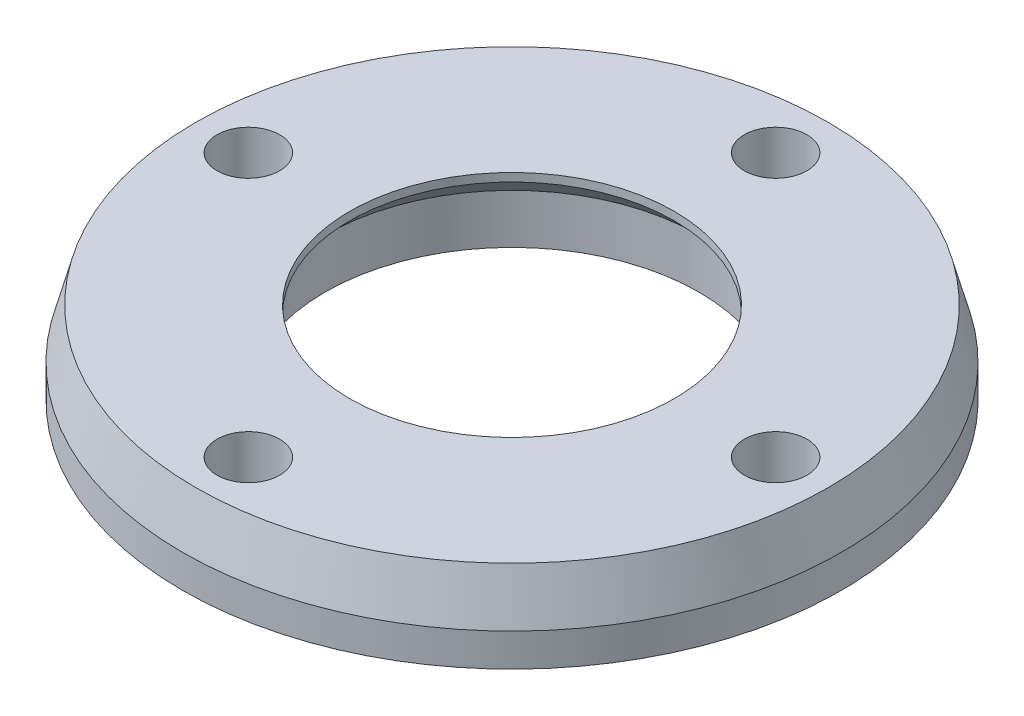
ISO-10303-21;
HEADER;
FILE_DESCRIPTION(('STEP AP214'),'2;1');
FILE_NAME('part.step','',(''),(''),'','','');
FILE_SCHEMA(('AUTOMOTIVE_DESIGN { 1 0 10303 214 1 1 1 1 }'));
ENDSEC;
DATA;
#1=APPLICATION_CONTEXT('core data for automotive mechanical design processes');
#2=APPLICATION_PROTOCOL_DEFINITION('international standard','automotive_design',2000,#1);
#3=PRODUCT_CONTEXT('',#1,'mechanical');
#4=PRODUCT('Part','Part','',(#3));
#5=PRODUCT_RELATED_PRODUCT_CATEGORY('part','',(#4));
#6=PRODUCT_DEFINITION_FORMATION('','',#4);
#7=PRODUCT_DEFINITION_CONTEXT('part definition',#1,'design');
#8=PRODUCT_DEFINITION('design','',#6,#7);
#9=PRODUCT_DEFINITION_SHAPE('','',#8);
#10=(LENGTH_UNIT() NAMED_UNIT(*) SI_UNIT(.MILLI.,.METRE.));
#11=(NAMED_UNIT(*) PLANE_ANGLE_UNIT() SI_UNIT($,.RADIAN.));
#12=(NAMED_UNIT(*) SI_UNIT($,.STERADIAN.) SOLID_ANGLE_UNIT());
#13=UNCERTAINTY_MEASURE_WITH_UNIT(LENGTH_MEASURE(1.E-05),#10,'distance_accuracy_value','');
#14=(GEOMETRIC_REPRESENTATION_CONTEXT(3) GLOBAL_UNCERTAINTY_ASSIGNED_CONTEXT((#13)) GLOBAL_UNIT_ASSIGNED_CONTEXT((#10,
#11,#12)) REPRESENTATION_CONTEXT('',''));
#15=CARTESIAN_POINT('',(0.,0.,0.));
#16=DIRECTION('',(0.,0.,1.));
#17=DIRECTION('',(1.,0.,0.));
#18=AXIS2_PLACEMENT_3D('',#15,#16,#17);
#19=CARTESIAN_POINT('',(0.,5.,0.));
#20=DIRECTION('',(0.,-1.,0.));
#21=DIRECTION('',(0.,0.,-1.));
#22=AXIS2_PLACEMENT_3D('',#19,#20,#21);
#23=CYLINDRICAL_SURFACE('',#22,11.35);
#24=CARTESIAN_POINT('',(0.,0.,0.));
#25=DIRECTION('',(0.,1.,0.));
#26=DIRECTION('',(0.,0.,1.));
#27=AXIS2_PLACEMENT_3D('',#24,#25,#26);
#28=CIRCLE('',#27,11.35);
#29=CARTESIAN_POINT('',(0.,0.,11.35));
#30=VERTEX_POINT('',#29);
#31=EDGE_CURVE('E58',#30,#30,#28,.T.);
#32=ORIENTED_EDGE('',*,*,#31,.F.);
#33=EDGE_LOOP('',(#32));
#34=FACE_BOUND('',#33,.T.);
#35=CARTESIAN_POINT('',(0.,3.,0.));
#36=DIRECTION('',(0.,1.,0.));
#37=DIRECTION('',(0.,0.,1.));
#38=AXIS2_PLACEMENT_3D('',#35,#36,#37);
#39=CIRCLE('',#38,11.35);
#40=CARTESIAN_POINT('',(0.,3.,-11.35));
#41=VERTEX_POINT('',#40);
#42=EDGE_CURVE('E83',#41,#41,#39,.T.);
#43=ORIENTED_EDGE('',*,*,#42,.T.);
#44=EDGE_LOOP('',(#43));
#45=FACE_BOUND('',#44,.T.);
#46=ADVANCED_FACE('F37',(#34,#45),#23,.F.);
#47=CARTESIAN_POINT('',(0.,5.,0.));
#48=DIRECTION('',(0.,1.,0.));
#49=DIRECTION('',(0.,0.,1.));
#50=AXIS2_PLACEMENT_3D('',#47,#48,#49);
#51=PLANE('',#50);
#52=CARTESIAN_POINT('',(0.,5.,0.));
#53=DIRECTION('',(0.,1.,0.));
#54=DIRECTION('',(0.,0.,1.));
#55=AXIS2_PLACEMENT_3D('',#52,#53,#54);
#56=CIRCLE('',#55,19.1961524227066);
#57=CARTESIAN_POINT('',(0.,5.,19.1961524227066));
#58=VERTEX_POINT('',#57);
#59=EDGE_CURVE('E49',#58,#58,#56,.T.);
#60=ORIENTED_EDGE('',*,*,#59,.T.);
#61=EDGE_LOOP('',(#60));
#62=FACE_BOUND('',#61,.T.);
#63=CARTESIAN_POINT('',(8.47262836995872E-13,5.,16.));
#64=DIRECTION('',(0.,1.,0.));
#65=DIRECTION('',(0.,0.,1.));
#66=AXIS2_PLACEMENT_3D('',#63,#64,#65);
#67=CIRCLE('',#66,1.9);
#68=CARTESIAN_POINT('',(8.47262836995872E-13,5.,17.9));
#69=VERTEX_POINT('',#68);
#70=EDGE_CURVE('E71',#69,#69,#67,.T.);
#71=ORIENTED_EDGE('',*,*,#70,.F.);
#72=EDGE_LOOP('',(#71));
#73=FACE_BOUND('',#72,.T.);
#74=CARTESIAN_POINT('',(0.,5.,-16.));
#75=DIRECTION('',(0.,1.,0.));
#76=DIRECTION('',(0.,0.,1.));
#77=AXIS2_PLACEMENT_3D('',#74,#75,#76);
#78=CIRCLE('',#77,1.9);
#79=CARTESIAN_POINT('',(0.,5.,-14.1));
#80=VERTEX_POINT('',#79);
#81=EDGE_CURVE('E61',#80,#80,#78,.T.);
#82=ORIENTED_EDGE('',*,*,#81,.F.);
#83=EDGE_LOOP('',(#82));
#84=FACE_BOUND('',#83,.T.);
#85=CARTESIAN_POINT('',(16.0000000000004,5.,-4.23631418497936E-13));
#86=DIRECTION('',(0.,1.,0.));
#87=DIRECTION('',(0.,0.,1.));
#88=AXIS2_PLACEMENT_3D('',#85,#86,#87);
#89=CIRCLE('',#88,1.9);
#90=CARTESIAN_POINT('',(16.0000000000004,5.,1.89999999999957));
#91=VERTEX_POINT('',#90);
#92=EDGE_CURVE('E65',#91,#91,#89,.T.);
#93=ORIENTED_EDGE('',*,*,#92,.F.);
#94=EDGE_LOOP('',(#93));
#95=FACE_BOUND('',#94,.T.);
#96=CARTESIAN_POINT('',(-15.9999999999996,5.,4.25590853376572E-13));
#97=DIRECTION('',(0.,1.,0.));
#98=DIRECTION('',(0.,0.,1.));
#99=AXIS2_PLACEMENT_3D('',#96,#97,#98);
#100=CIRCLE('',#99,1.9);
#101=CARTESIAN_POINT('',(-15.9999999999996,5.,1.90000000000043));
#102=VERTEX_POINT('',#101);
#103=EDGE_CURVE('E77',#102,#102,#100,.T.);
#104=ORIENTED_EDGE('',*,*,#103,.F.);
#105=EDGE_LOOP('',(#104));
#106=FACE_BOUND('',#105,.T.);
#107=CARTESIAN_POINT('',(0.,5.,0.));
#108=DIRECTION('',(0.,1.,0.));
#109=DIRECTION('',(0.,0.,1.));
#110=AXIS2_PLACEMENT_3D('',#107,#108,#109);
#111=CIRCLE('',#110,9.85);
#112=CARTESIAN_POINT('',(0.,5.,9.85));
#113=VERTEX_POINT('',#112);
#114=EDGE_CURVE('E88',#113,#113,#111,.T.);
#115=ORIENTED_EDGE('',*,*,#114,.F.);
#116=EDGE_LOOP('',(#115));
#117=FACE_BOUND('',#116,.T.);
#118=ADVANCED_FACE('F94',(#62,#73,#84,#95,#106,#117),#51,.T.);
#119=CARTESIAN_POINT('',(0.,0.,0.));
#120=DIRECTION('',(0.,1.,0.));
#121=DIRECTION('',(0.,0.,1.));
#122=AXIS2_PLACEMENT_3D('',#119,#120,#121);
#123=PLANE('',#122);
#124=CARTESIAN_POINT('',(0.,0.,0.));
#125=DIRECTION('',(0.,1.,0.));
#126=DIRECTION('',(0.,0.,1.));
#127=AXIS2_PLACEMENT_3D('',#124,#125,#126);
#128=CIRCLE('',#127,20.);
#129=CARTESIAN_POINT('',(0.,0.,20.));
#130=VERTEX_POINT('',#129);
#131=EDGE_CURVE('E53',#130,#130,#128,.T.);
#132=ORIENTED_EDGE('',*,*,#131,.F.);
#133=EDGE_LOOP('',(#132));
#134=FACE_BOUND('',#133,.T.);
#135=ORIENTED_EDGE('',*,*,#31,.T.);
#136=EDGE_LOOP('',(#135));
#137=FACE_BOUND('',#136,.T.);
#138=CARTESIAN_POINT('',(0.,0.,-16.));
#139=DIRECTION('',(0.,1.,0.));
#140=DIRECTION('',(0.,0.,1.));
#141=AXIS2_PLACEMENT_3D('',#138,#139,#140);
#142=CIRCLE('',#141,1.9);
#143=CARTESIAN_POINT('',(0.,0.,-14.1));
#144=VERTEX_POINT('',#143);
#145=EDGE_CURVE('E62',#144,#144,#142,.T.);
#146=ORIENTED_EDGE('',*,*,#145,.T.);
#147=EDGE_LOOP('',(#146));
#148=FACE_BOUND('',#147,.T.);
#149=CARTESIAN_POINT('',(16.0000000000004,0.,-4.23631418497936E-13));
#150=DIRECTION('',(0.,1.,0.));
#151=DIRECTION('',(0.,0.,1.));
#152=AXIS2_PLACEMENT_3D('',#149,#150,#151);
#153=CIRCLE('',#152,1.9);
#154=CARTESIAN_POINT('',(16.0000000000004,0.,1.89999999999957));
#155=VERTEX_POINT('',#154);
#156=EDGE_CURVE('E68',#155,#155,#153,.T.);
#157=ORIENTED_EDGE('',*,*,#156,.T.);
#158=EDGE_LOOP('',(#157));
#159=FACE_BOUND('',#158,.T.);
#160=CARTESIAN_POINT('',(8.47262836995872E-13,0.,16.));
#161=DIRECTION('',(0.,1.,0.));
#162=DIRECTION('',(0.,0.,1.));
#163=AXIS2_PLACEMENT_3D('',#160,#161,#162);
#164=CIRCLE('',#163,1.9);
#165=CARTESIAN_POINT('',(8.47262836995872E-13,0.,17.9));
#166=VERTEX_POINT('',#165);
#167=EDGE_CURVE('E74',#166,#166,#164,.T.);
#168=ORIENTED_EDGE('',*,*,#167,.T.);
#169=EDGE_LOOP('',(#168));
#170=FACE_BOUND('',#169,.T.);
#171=CARTESIAN_POINT('',(-15.9999999999996,0.,4.25590853376572E-13));
#172=DIRECTION('',(0.,1.,0.));
#173=DIRECTION('',(0.,0.,1.));
#174=AXIS2_PLACEMENT_3D('',#171,#172,#173);
#175=CIRCLE('',#174,1.9);
#176=CARTESIAN_POINT('',(-15.9999999999996,0.,1.90000000000043));
#177=VERTEX_POINT('',#176);
#178=EDGE_CURVE('E80',#177,#177,#175,.T.);
#179=ORIENTED_EDGE('',*,*,#178,.T.);
#180=EDGE_LOOP('',(#179));
#181=FACE_BOUND('',#180,.T.);
#182=ADVANCED_FACE('F96',(#134,#137,#148,#159,#170,#181),#123,.F.);
#183=CARTESIAN_POINT('',(0.,5.,0.));
#184=DIRECTION('',(0.,-1.,0.));
#185=DIRECTION('',(0.,0.,-1.));
#186=AXIS2_PLACEMENT_3D('',#183,#184,#185);
#187=CYLINDRICAL_SURFACE('',#186,20.);
#188=CARTESIAN_POINT('',(0.,2.00000000000002,0.));
#189=DIRECTION('',(0.,1.,0.));
#190=DIRECTION('',(0.,0.,1.));
#191=AXIS2_PLACEMENT_3D('',#188,#189,#190);
#192=CIRCLE('',#191,20.);
#193=CARTESIAN_POINT('',(0.,2.00000000000002,20.));
#194=VERTEX_POINT('',#193);
#195=EDGE_CURVE('E45',#194,#194,#192,.F.);
#196=ORIENTED_EDGE('',*,*,#195,.T.);
#197=EDGE_LOOP('',(#196));
#198=FACE_BOUND('',#197,.T.);
#199=ORIENTED_EDGE('',*,*,#131,.T.);
#200=EDGE_LOOP('',(#199));
#201=FACE_BOUND('',#200,.T.);
#202=ADVANCED_FACE('F103',(#198,#201),#187,.T.);
#203=CARTESIAN_POINT('',(0.,5.,-16.));
#204=DIRECTION('',(0.,-1.,0.));
#205=DIRECTION('',(0.,0.,-1.));
#206=AXIS2_PLACEMENT_3D('',#203,#204,#205);
#207=CYLINDRICAL_SURFACE('',#206,1.9);
#208=ORIENTED_EDGE('',*,*,#81,.T.);
#209=EDGE_LOOP('',(#208));
#210=FACE_BOUND('',#209,.T.);
#211=ORIENTED_EDGE('',*,*,#145,.F.);
#212=EDGE_LOOP('',(#211));
#213=FACE_BOUND('',#212,.T.);
#214=ADVANCED_FACE('F112',(#210,#213),#207,.F.);
#215=CARTESIAN_POINT('',(16.0000000000004,5.,-4.23631418497936E-13));
#216=DIRECTION('',(0.,-1.,0.));
#217=DIRECTION('',(0.,0.,-1.));
#218=AXIS2_PLACEMENT_3D('',#215,#216,#217);
#219=CYLINDRICAL_SURFACE('',#218,1.9);
#220=ORIENTED_EDGE('',*,*,#92,.T.);
#221=EDGE_LOOP('',(#220));
#222=FACE_BOUND('',#221,.T.);
#223=ORIENTED_EDGE('',*,*,#156,.F.);
#224=EDGE_LOOP('',(#223));
#225=FACE_BOUND('',#224,.T.);
#226=ADVANCED_FACE('F133',(#222,#225),#219,.F.);
#227=CARTESIAN_POINT('',(8.47262836995872E-13,5.,16.));
#228=DIRECTION('',(0.,-1.,0.));
#229=DIRECTION('',(0.,0.,-1.));
#230=AXIS2_PLACEMENT_3D('',#227,#228,#229);
#231=CYLINDRICAL_SURFACE('',#230,1.9);
#232=ORIENTED_EDGE('',*,*,#70,.T.);
#233=EDGE_LOOP('',(#232));
#234=FACE_BOUND('',#233,.T.);
#235=ORIENTED_EDGE('',*,*,#167,.F.);
#236=EDGE_LOOP('',(#235));
#237=FACE_BOUND('',#236,.T.);
#238=ADVANCED_FACE('F125',(#234,#237),#231,.F.);
#239=CARTESIAN_POINT('',(-15.9999999999996,5.,4.25590853376572E-13));
#240=DIRECTION('',(0.,-1.,0.));
#241=DIRECTION('',(0.,0.,-1.));
#242=AXIS2_PLACEMENT_3D('',#239,#240,#241);
#243=CYLINDRICAL_SURFACE('',#242,1.9);
#244=ORIENTED_EDGE('',*,*,#103,.T.);
#245=EDGE_LOOP('',(#244));
#246=FACE_BOUND('',#245,.T.);
#247=ORIENTED_EDGE('',*,*,#178,.F.);
#248=EDGE_LOOP('',(#247));
#249=FACE_BOUND('',#248,.T.);
#250=ADVANCED_FACE('F118',(#246,#249),#243,.F.);
#251=CARTESIAN_POINT('',(0.,5.,0.));
#252=DIRECTION('',(0.,-1.,0.));
#253=DIRECTION('',(0.,0.,-1.));
#254=AXIS2_PLACEMENT_3D('',#251,#252,#253);
#255=CONICAL_SURFACE('',#254,19.1961524227066,0.261799387799148);
#256=ORIENTED_EDGE('',*,*,#195,.F.);
#257=EDGE_LOOP('',(#256));
#258=FACE_BOUND('',#257,.T.);
#259=ORIENTED_EDGE('',*,*,#59,.F.);
#260=EDGE_LOOP('',(#259));
#261=FACE_BOUND('',#260,.T.);
#262=ADVANCED_FACE('F114',(#258,#261),#255,.T.);
#263=CARTESIAN_POINT('',(0.,3.,0.));
#264=DIRECTION('',(0.,1.,0.));
#265=DIRECTION('',(0.,0.,1.));
#266=AXIS2_PLACEMENT_3D('',#263,#264,#265);
#267=CYLINDRICAL_SURFACE('',#266,9.85);
#268=CARTESIAN_POINT('',(0.,4.5,0.));
#269=DIRECTION('',(0.,1.,0.));
#270=DIRECTION('',(0.,0.,1.));
#271=AXIS2_PLACEMENT_3D('',#268,#269,#270);
#272=CIRCLE('',#271,9.85);
#273=CARTESIAN_POINT('',(0.,4.5,-9.85));
#274=VERTEX_POINT('',#273);
#275=EDGE_CURVE('E10',#274,#274,#272,.F.);
#276=ORIENTED_EDGE('',*,*,#275,.T.);
#277=EDGE_LOOP('',(#276));
#278=FACE_BOUND('',#277,.T.);
#279=ORIENTED_EDGE('',*,*,#114,.T.);
#280=EDGE_LOOP('',(#279));
#281=FACE_BOUND('',#280,.T.);
#282=ADVANCED_FACE('F92',(#278,#281),#267,.F.);
#283=CARTESIAN_POINT('',(0.,3.,0.));
#284=DIRECTION('',(0.,-1.,0.));
#285=DIRECTION('',(0.,0.,-1.));
#286=AXIS2_PLACEMENT_3D('',#283,#284,#285);
#287=CONICAL_SURFACE('',#286,11.35,0.785398163397447);
#288=CARTESIAN_POINT('',(0.,4.5,-9.85));
#289=CARTESIAN_POINT('',(0.,4.484375,-9.865625));
#290=CARTESIAN_POINT('',(0.,4.46875,-9.88125));
#291=CARTESIAN_POINT('',(0.,4.4375,-9.9125));
#292=CARTESIAN_POINT('',(0.,4.421875,-9.928125));
#293=CARTESIAN_POINT('',(0.,4.390625,-9.959375));
#294=CARTESIAN_POINT('',(0.,4.375,-9.975));
#295=CARTESIAN_POINT('',(0.,4.34375,-10.00625));
#296=CARTESIAN_POINT('',(0.,4.328125,-10.021875));
#297=CARTESIAN_POINT('',(0.,4.296875,-10.053125));
#298=CARTESIAN_POINT('',(0.,4.28125,-10.06875));
#299=CARTESIAN_POINT('',(0.,4.25,-10.1));
#300=CARTESIAN_POINT('',(0.,4.234375,-10.115625));
#301=CARTESIAN_POINT('',(0.,4.203125,-10.146875));
#302=CARTESIAN_POINT('',(0.,4.1875,-10.1625));
#303=CARTESIAN_POINT('',(0.,4.15625,-10.19375));
#304=CARTESIAN_POINT('',(0.,4.140625,-10.209375));
#305=CARTESIAN_POINT('',(0.,4.109375,-10.240625));
#306=CARTESIAN_POINT('',(0.,4.09375,-10.25625));
#307=CARTESIAN_POINT('',(0.,4.0625,-10.2875));
#308=CARTESIAN_POINT('',(0.,4.046875,-10.303125));
#309=CARTESIAN_POINT('',(0.,4.015625,-10.334375));
#310=CARTESIAN_POINT('',(0.,4.,-10.35));
#311=CARTESIAN_POINT('',(0.,3.96875,-10.38125));
#312=CARTESIAN_POINT('',(0.,3.953125,-10.396875));
#313=CARTESIAN_POINT('',(0.,3.921875,-10.428125));
#314=CARTESIAN_POINT('',(0.,3.90625,-10.44375));
#315=CARTESIAN_POINT('',(0.,3.875,-10.475));
#316=CARTESIAN_POINT('',(0.,3.859375,-10.490625));
#317=CARTESIAN_POINT('',(0.,3.828125,-10.521875));
#318=CARTESIAN_POINT('',(0.,3.8125,-10.5375));
#319=CARTESIAN_POINT('',(0.,3.78125,-10.56875));
#320=CARTESIAN_POINT('',(0.,3.765625,-10.584375));
#321=CARTESIAN_POINT('',(0.,3.734375,-10.615625));
#322=CARTESIAN_POINT('',(0.,3.71875,-10.63125));
#323=CARTESIAN_POINT('',(0.,3.6875,-10.6625));
#324=CARTESIAN_POINT('',(0.,3.671875,-10.678125));
#325=CARTESIAN_POINT('',(0.,3.640625,-10.709375));
#326=CARTESIAN_POINT('',(0.,3.625,-10.725));
#327=CARTESIAN_POINT('',(0.,3.59375,-10.75625));
#328=CARTESIAN_POINT('',(0.,3.578125,-10.771875));
#329=CARTESIAN_POINT('',(0.,3.546875,-10.803125));
#330=CARTESIAN_POINT('',(0.,3.53125,-10.81875));
#331=CARTESIAN_POINT('',(0.,3.5,-10.85));
#332=CARTESIAN_POINT('',(0.,3.484375,-10.865625));
#333=CARTESIAN_POINT('',(0.,3.453125,-10.896875));
#334=CARTESIAN_POINT('',(0.,3.4375,-10.9125));
#335=CARTESIAN_POINT('',(0.,3.40625,-10.94375));
#336=CARTESIAN_POINT('',(0.,3.390625,-10.959375));
#337=CARTESIAN_POINT('',(0.,3.359375,-10.990625));
#338=CARTESIAN_POINT('',(0.,3.34375,-11.00625));
#339=CARTESIAN_POINT('',(0.,3.3125,-11.0375));
#340=CARTESIAN_POINT('',(0.,3.296875,-11.053125));
#341=CARTESIAN_POINT('',(0.,3.265625,-11.084375));
#342=CARTESIAN_POINT('',(0.,3.25,-11.1));
#343=CARTESIAN_POINT('',(0.,3.21875,-11.13125));
#344=CARTESIAN_POINT('',(0.,3.203125,-11.146875));
#345=CARTESIAN_POINT('',(0.,3.171875,-11.178125));
#346=CARTESIAN_POINT('',(0.,3.15625,-11.19375));
#347=CARTESIAN_POINT('',(0.,3.125,-11.225));
#348=CARTESIAN_POINT('',(0.,3.109375,-11.240625));
#349=CARTESIAN_POINT('',(0.,3.078125,-11.271875));
#350=CARTESIAN_POINT('',(0.,3.0625,-11.2875));
#351=CARTESIAN_POINT('',(0.,3.03125,-11.31875));
#352=CARTESIAN_POINT('',(0.,3.015625,-11.334375));
#353=CARTESIAN_POINT('',(0.,3.,-11.35));
#354=B_SPLINE_CURVE_WITH_KNOTS('',3,(#288,#289,#290,#291,#292,#293,#294,#295,#296,#297,#298,
#299,#300,#301,#302,#303,#304,#305,#306,#307,#308,#309,#310,#311,#312,#313,#314,#315,#316,#317,
#318,#319,#320,#321,#322,#323,#324,#325,#326,#327,#328,#329,#330,#331,#332,#333,#334,#335,#336,
#337,#338,#339,#340,#341,#342,#343,#344,#345,#346,#347,#348,#349,#350,#351,#352,#353),
.UNSPECIFIED.,.F.,.F.,(4,2,2,2,2,2,2,2,2,2,2,2,2,2,2,2,2,2,2,2,2,2,2,2,2,2,2,2,2,2,2,2,4),(0.,
0.0662912607362389,0.132582521472478,0.198873782208717,0.265165042944954,0.331456303681193,
0.397747564417432,0.464038825153671,0.530330085889909,0.596621346626148,0.662912607362387,
0.729203868098624,0.795495128834863,0.861786389571102,0.928077650307341,0.99436891104358,
1.06066017177982,1.12695143251606,1.19324269325229,1.25953395398853,1.32582521472477,
1.39211647546101,1.45840773619725,1.52469899693349,1.59099025766973,1.65728151840596,
1.7235727791422,1.78986403987844,1.85615530061468,1.92244656135092,1.98873782208716,
2.0550290828234,2.12132034355963),.UNSPECIFIED.);
#355=EDGE_CURVE('BSEAM40',#274,#41,#354,.T.);
#356=ORIENTED_EDGE('',*,*,#275,.F.);
#357=ORIENTED_EDGE('',*,*,#42,.F.);
#358=ORIENTED_EDGE('',*,*,#355,.T.);
#359=ORIENTED_EDGE('',*,*,#355,.F.);
#360=EDGE_LOOP('',(#356,#358,#357,#359));
#361=FACE_BOUND('',#360,.T.);
#362=ADVANCED_FACE('F40',(#361),#287,.F.);
#363=CLOSED_SHELL('',(#46,#118,#182,#202,#214,#226,#238,#250,#262,#282,#362));
#364=MANIFOLD_SOLID_BREP('B2',#363);
#365=ADVANCED_BREP_SHAPE_REPRESENTATION('',(#18,#364),#14);
#366=SHAPE_DEFINITION_REPRESENTATION(#9,#365);
ENDSEC;
END-ISO-10303-21;
